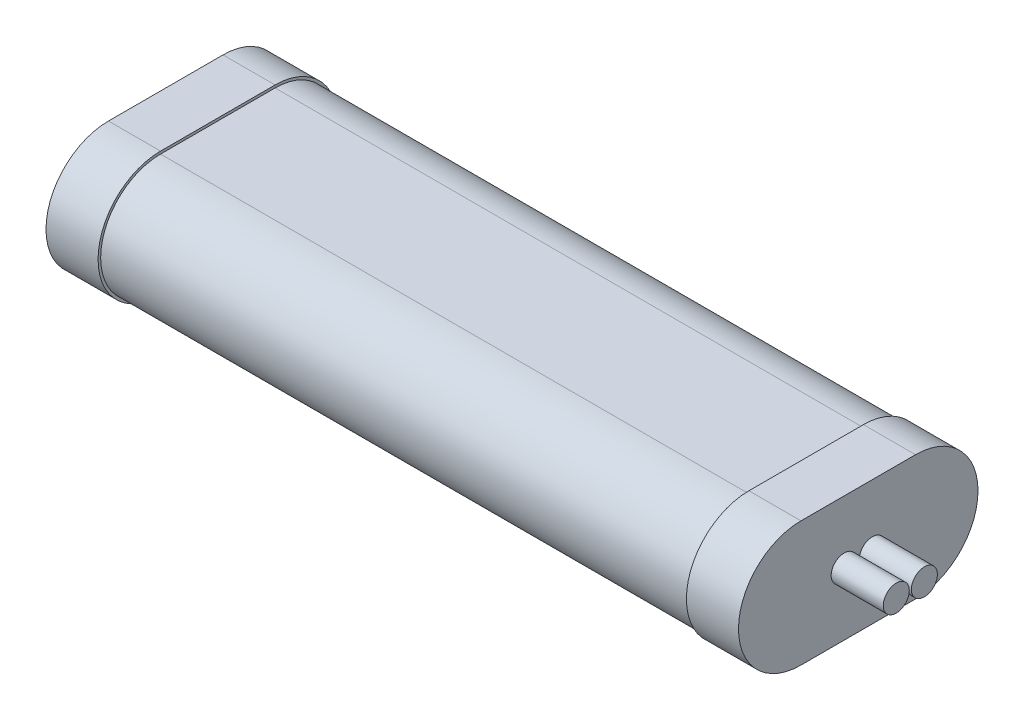
ISO-10303-21;
HEADER;
FILE_DESCRIPTION(('STEP AP214'),'2;1');
FILE_NAME('part.step','',(''),(''),'','','');
FILE_SCHEMA(('AUTOMOTIVE_DESIGN { 1 0 10303 214 1 1 1 1 }'));
ENDSEC;
DATA;
#1=APPLICATION_CONTEXT('core data for automotive mechanical design processes');
#2=APPLICATION_PROTOCOL_DEFINITION('international standard','automotive_design',2000,#1);
#3=PRODUCT_CONTEXT('',#1,'mechanical');
#4=PRODUCT('Part','Part','',(#3));
#5=PRODUCT_RELATED_PRODUCT_CATEGORY('part','',(#4));
#6=PRODUCT_DEFINITION_FORMATION('','',#4);
#7=PRODUCT_DEFINITION_CONTEXT('part definition',#1,'design');
#8=PRODUCT_DEFINITION('design','',#6,#7);
#9=PRODUCT_DEFINITION_SHAPE('','',#8);
#10=(LENGTH_UNIT() NAMED_UNIT(*) SI_UNIT(.MILLI.,.METRE.));
#11=(NAMED_UNIT(*) PLANE_ANGLE_UNIT() SI_UNIT($,.RADIAN.));
#12=(NAMED_UNIT(*) SI_UNIT($,.STERADIAN.) SOLID_ANGLE_UNIT());
#13=UNCERTAINTY_MEASURE_WITH_UNIT(LENGTH_MEASURE(1.E-05),#10,'distance_accuracy_value','');
#14=(GEOMETRIC_REPRESENTATION_CONTEXT(3) GLOBAL_UNCERTAINTY_ASSIGNED_CONTEXT((#13)) GLOBAL_UNIT_ASSIGNED_CONTEXT((#10,
#11,#12)) REPRESENTATION_CONTEXT('',''));
#15=CARTESIAN_POINT('',(0.,0.,0.));
#16=DIRECTION('',(0.,0.,1.));
#17=DIRECTION('',(1.,0.,0.));
#18=AXIS2_PLACEMENT_3D('',#15,#16,#17);
#19=CARTESIAN_POINT('',(56.5,0.,11.));
#20=DIRECTION('',(-1.,0.,0.));
#21=DIRECTION('',(0.,0.,1.));
#22=AXIS2_PLACEMENT_3D('',#19,#20,#21);
#23=CYLINDRICAL_SURFACE('',#22,11.5);
#24=CARTESIAN_POINT('',(-56.5,0.,11.));
#25=DIRECTION('',(1.,0.,0.));
#26=DIRECTION('',(0.,0.,-1.));
#27=AXIS2_PLACEMENT_3D('',#24,#25,#26);
#28=CIRCLE('',#27,11.5);
#29=CARTESIAN_POINT('',(-56.5,11.5,11.));
#30=VERTEX_POINT('',#29);
#31=CARTESIAN_POINT('',(-56.5,-11.5,11.));
#32=VERTEX_POINT('',#31);
#33=EDGE_CURVE('E207',#30,#32,#28,.T.);
#34=ORIENTED_EDGE('',*,*,#33,.T.);
#35=DIRECTION('',(-1.,0.,0.));
#36=VECTOR('',#35,1.);
#37=CARTESIAN_POINT('',(56.5,-11.5,11.));
#38=LINE('',#37,#36);
#39=CARTESIAN_POINT('',(56.5,-11.5,11.));
#40=VERTEX_POINT('',#39);
#41=EDGE_CURVE('E51',#40,#32,#38,.T.);
#42=ORIENTED_EDGE('',*,*,#41,.F.);
#43=CARTESIAN_POINT('',(56.5,0.,11.));
#44=DIRECTION('',(1.,0.,0.));
#45=DIRECTION('',(0.,0.,-1.));
#46=AXIS2_PLACEMENT_3D('',#43,#44,#45);
#47=CIRCLE('',#46,11.5);
#48=CARTESIAN_POINT('',(56.5,11.5,11.));
#49=VERTEX_POINT('',#48);
#50=EDGE_CURVE('E208',#49,#40,#47,.T.);
#51=ORIENTED_EDGE('',*,*,#50,.F.);
#52=DIRECTION('',(-1.,0.,0.));
#53=VECTOR('',#52,1.);
#54=CARTESIAN_POINT('',(56.5,11.5,11.));
#55=LINE('',#54,#53);
#56=EDGE_CURVE('E221',#49,#30,#55,.T.);
#57=ORIENTED_EDGE('',*,*,#56,.T.);
#58=EDGE_LOOP('',(#34,#42,#51,#57));
#59=FACE_BOUND('',#58,.T.);
#60=ADVANCED_FACE('F48',(#59),#23,.T.);
#61=CARTESIAN_POINT('',(56.5,-11.5,11.));
#62=DIRECTION('',(0.,1.,0.));
#63=DIRECTION('',(0.,0.,1.));
#64=AXIS2_PLACEMENT_3D('',#61,#62,#63);
#65=PLANE('',#64);
#66=DIRECTION('',(0.,0.,-1.));
#67=VECTOR('',#66,1.);
#68=CARTESIAN_POINT('',(-56.5,-11.5,11.));
#69=LINE('',#68,#67);
#70=CARTESIAN_POINT('',(-56.5,-11.5,-11.));
#71=VERTEX_POINT('',#70);
#72=EDGE_CURVE('E224',#32,#71,#69,.T.);
#73=ORIENTED_EDGE('',*,*,#72,.T.);
#74=DIRECTION('',(-1.,0.,0.));
#75=VECTOR('',#74,1.);
#76=CARTESIAN_POINT('',(56.5,-11.5,-11.));
#77=LINE('',#76,#75);
#78=CARTESIAN_POINT('',(56.5,-11.5,-11.));
#79=VERTEX_POINT('',#78);
#80=EDGE_CURVE('E233',#79,#71,#77,.T.);
#81=ORIENTED_EDGE('',*,*,#80,.F.);
#82=DIRECTION('',(0.,0.,-1.));
#83=VECTOR('',#82,1.);
#84=CARTESIAN_POINT('',(56.5,-11.5,11.));
#85=LINE('',#84,#83);
#86=EDGE_CURVE('E211',#40,#79,#85,.T.);
#87=ORIENTED_EDGE('',*,*,#86,.F.);
#88=ORIENTED_EDGE('',*,*,#41,.T.);
#89=EDGE_LOOP('',(#73,#81,#87,#88));
#90=FACE_BOUND('',#89,.T.);
#91=ADVANCED_FACE('F238',(#90),#65,.F.);
#92=CARTESIAN_POINT('',(56.5,0.,-11.));
#93=DIRECTION('',(-1.,0.,0.));
#94=DIRECTION('',(0.,0.,1.));
#95=AXIS2_PLACEMENT_3D('',#92,#93,#94);
#96=CYLINDRICAL_SURFACE('',#95,11.5);
#97=CARTESIAN_POINT('',(-56.5,0.,-11.));
#98=DIRECTION('',(1.,0.,0.));
#99=DIRECTION('',(0.,0.,1.));
#100=AXIS2_PLACEMENT_3D('',#97,#98,#99);
#101=CIRCLE('',#100,11.5);
#102=CARTESIAN_POINT('',(-56.5,11.5,-11.));
#103=VERTEX_POINT('',#102);
#104=EDGE_CURVE('E227',#71,#103,#101,.T.);
#105=ORIENTED_EDGE('',*,*,#104,.T.);
#106=DIRECTION('',(-1.,0.,0.));
#107=VECTOR('',#106,1.);
#108=CARTESIAN_POINT('',(56.5,11.5,-11.));
#109=LINE('',#108,#107);
#110=CARTESIAN_POINT('',(56.5,11.5,-11.));
#111=VERTEX_POINT('',#110);
#112=EDGE_CURVE('E64',#111,#103,#109,.T.);
#113=ORIENTED_EDGE('',*,*,#112,.F.);
#114=CARTESIAN_POINT('',(56.5,0.,-11.));
#115=DIRECTION('',(1.,0.,0.));
#116=DIRECTION('',(0.,0.,1.));
#117=AXIS2_PLACEMENT_3D('',#114,#115,#116);
#118=CIRCLE('',#117,11.5);
#119=EDGE_CURVE('E215',#79,#111,#118,.T.);
#120=ORIENTED_EDGE('',*,*,#119,.F.);
#121=ORIENTED_EDGE('',*,*,#80,.T.);
#122=EDGE_LOOP('',(#105,#113,#120,#121));
#123=FACE_BOUND('',#122,.T.);
#124=ADVANCED_FACE('F249',(#123),#96,.T.);
#125=CARTESIAN_POINT('',(56.5,11.5,11.));
#126=DIRECTION('',(0.,-1.,0.));
#127=DIRECTION('',(0.,0.,-1.));
#128=AXIS2_PLACEMENT_3D('',#125,#126,#127);
#129=PLANE('',#128);
#130=DIRECTION('',(0.,0.,1.));
#131=VECTOR('',#130,1.);
#132=CARTESIAN_POINT('',(-56.5,11.5,11.));
#133=LINE('',#132,#131);
#134=EDGE_CURVE('E212',#103,#30,#133,.T.);
#135=ORIENTED_EDGE('',*,*,#134,.T.);
#136=ORIENTED_EDGE('',*,*,#56,.F.);
#137=DIRECTION('',(0.,0.,1.));
#138=VECTOR('',#137,1.);
#139=CARTESIAN_POINT('',(56.5,11.5,11.));
#140=LINE('',#139,#138);
#141=EDGE_CURVE('E218',#111,#49,#140,.T.);
#142=ORIENTED_EDGE('',*,*,#141,.F.);
#143=ORIENTED_EDGE('',*,*,#112,.T.);
#144=EDGE_LOOP('',(#135,#136,#142,#143));
#145=FACE_BOUND('',#144,.T.);
#146=ADVANCED_FACE('F246',(#145),#129,.F.);
#147=CARTESIAN_POINT('',(56.5,0.,11.));
#148=DIRECTION('',(1.,0.,0.));
#149=DIRECTION('',(0.,0.,-1.));
#150=AXIS2_PLACEMENT_3D('',#147,#148,#149);
#151=PLANE('',#150);
#152=CARTESIAN_POINT('',(56.5,0.,11.));
#153=DIRECTION('',(1.,0.,0.));
#154=DIRECTION('',(0.,0.,-1.));
#155=AXIS2_PLACEMENT_3D('',#152,#153,#154);
#156=CIRCLE('',#155,12.);
#157=CARTESIAN_POINT('',(56.5,12.,11.));
#158=VERTEX_POINT('',#157);
#159=CARTESIAN_POINT('',(56.5,-12.,11.));
#160=VERTEX_POINT('',#159);
#161=EDGE_CURVE('E145',#158,#160,#156,.T.);
#162=ORIENTED_EDGE('',*,*,#161,.F.);
#163=DIRECTION('',(0.,0.,1.));
#164=VECTOR('',#163,1.);
#165=CARTESIAN_POINT('',(56.5,12.,11.));
#166=LINE('',#165,#164);
#167=CARTESIAN_POINT('',(56.5,12.,-11.));
#168=VERTEX_POINT('',#167);
#169=EDGE_CURVE('E182',#168,#158,#166,.T.);
#170=ORIENTED_EDGE('',*,*,#169,.F.);
#171=CARTESIAN_POINT('',(56.5,0.,-11.));
#172=DIRECTION('',(1.,0.,0.));
#173=DIRECTION('',(0.,0.,1.));
#174=AXIS2_PLACEMENT_3D('',#171,#172,#173);
#175=CIRCLE('',#174,12.);
#176=CARTESIAN_POINT('',(56.5,-12.,-11.));
#177=VERTEX_POINT('',#176);
#178=EDGE_CURVE('E193',#177,#168,#175,.T.);
#179=ORIENTED_EDGE('',*,*,#178,.F.);
#180=DIRECTION('',(0.,0.,-1.));
#181=VECTOR('',#180,1.);
#182=CARTESIAN_POINT('',(56.5,-12.,11.));
#183=LINE('',#182,#181);
#184=EDGE_CURVE('E191',#160,#177,#183,.T.);
#185=ORIENTED_EDGE('',*,*,#184,.F.);
#186=EDGE_LOOP('',(#162,#170,#179,#185));
#187=FACE_BOUND('',#186,.T.);
#188=ORIENTED_EDGE('',*,*,#141,.T.);
#189=ORIENTED_EDGE('',*,*,#50,.T.);
#190=ORIENTED_EDGE('',*,*,#86,.T.);
#191=ORIENTED_EDGE('',*,*,#119,.T.);
#192=EDGE_LOOP('',(#188,#189,#190,#191));
#193=FACE_BOUND('',#192,.T.);
#194=ADVANCED_FACE('F248',(#187,#193),#151,.F.);
#195=CARTESIAN_POINT('',(66.5,0.,11.));
#196=DIRECTION('',(-1.,0.,0.));
#197=DIRECTION('',(0.,0.,1.));
#198=AXIS2_PLACEMENT_3D('',#195,#196,#197);
#199=CYLINDRICAL_SURFACE('',#198,12.);
#200=ORIENTED_EDGE('',*,*,#161,.T.);
#201=DIRECTION('',(-1.,0.,0.));
#202=VECTOR('',#201,1.);
#203=CARTESIAN_POINT('',(66.5,-12.,11.));
#204=LINE('',#203,#202);
#205=CARTESIAN_POINT('',(66.5,-12.,11.));
#206=VERTEX_POINT('',#205);
#207=EDGE_CURVE('E204',#206,#160,#204,.T.);
#208=ORIENTED_EDGE('',*,*,#207,.F.);
#209=CARTESIAN_POINT('',(66.5,0.,11.));
#210=DIRECTION('',(1.,0.,0.));
#211=DIRECTION('',(0.,0.,-1.));
#212=AXIS2_PLACEMENT_3D('',#209,#210,#211);
#213=CIRCLE('',#212,12.);
#214=CARTESIAN_POINT('',(66.5,12.,11.));
#215=VERTEX_POINT('',#214);
#216=EDGE_CURVE('E178',#215,#206,#213,.T.);
#217=ORIENTED_EDGE('',*,*,#216,.F.);
#218=DIRECTION('',(-1.,0.,0.));
#219=VECTOR('',#218,1.);
#220=CARTESIAN_POINT('',(66.5,12.,11.));
#221=LINE('',#220,#219);
#222=EDGE_CURVE('E188',#215,#158,#221,.T.);
#223=ORIENTED_EDGE('',*,*,#222,.T.);
#224=EDGE_LOOP('',(#200,#208,#217,#223));
#225=FACE_BOUND('',#224,.T.);
#226=ADVANCED_FACE('F284',(#225),#199,.T.);
#227=CARTESIAN_POINT('',(66.5,-12.,11.));
#228=DIRECTION('',(0.,1.,0.));
#229=DIRECTION('',(0.,0.,1.));
#230=AXIS2_PLACEMENT_3D('',#227,#228,#229);
#231=PLANE('',#230);
#232=ORIENTED_EDGE('',*,*,#184,.T.);
#233=DIRECTION('',(-1.,0.,0.));
#234=VECTOR('',#233,1.);
#235=CARTESIAN_POINT('',(66.5,-12.,-11.));
#236=LINE('',#235,#234);
#237=CARTESIAN_POINT('',(66.5,-12.,-11.));
#238=VERTEX_POINT('',#237);
#239=EDGE_CURVE('E201',#238,#177,#236,.T.);
#240=ORIENTED_EDGE('',*,*,#239,.F.);
#241=DIRECTION('',(0.,0.,-1.));
#242=VECTOR('',#241,1.);
#243=CARTESIAN_POINT('',(66.5,-12.,11.));
#244=LINE('',#243,#242);
#245=EDGE_CURVE('E181',#206,#238,#244,.T.);
#246=ORIENTED_EDGE('',*,*,#245,.F.);
#247=ORIENTED_EDGE('',*,*,#207,.T.);
#248=EDGE_LOOP('',(#232,#240,#246,#247));
#249=FACE_BOUND('',#248,.T.);
#250=ADVANCED_FACE('F294',(#249),#231,.F.);
#251=CARTESIAN_POINT('',(66.5,0.,-11.));
#252=DIRECTION('',(-1.,0.,0.));
#253=DIRECTION('',(0.,0.,1.));
#254=AXIS2_PLACEMENT_3D('',#251,#252,#253);
#255=CYLINDRICAL_SURFACE('',#254,12.);
#256=ORIENTED_EDGE('',*,*,#178,.T.);
#257=DIRECTION('',(-1.,0.,0.));
#258=VECTOR('',#257,1.);
#259=CARTESIAN_POINT('',(66.5,12.,-11.));
#260=LINE('',#259,#258);
#261=CARTESIAN_POINT('',(66.5,12.,-11.));
#262=VERTEX_POINT('',#261);
#263=EDGE_CURVE('E198',#262,#168,#260,.T.);
#264=ORIENTED_EDGE('',*,*,#263,.F.);
#265=CARTESIAN_POINT('',(66.5,0.,-11.));
#266=DIRECTION('',(1.,0.,0.));
#267=DIRECTION('',(0.,0.,1.));
#268=AXIS2_PLACEMENT_3D('',#265,#266,#267);
#269=CIRCLE('',#268,12.);
#270=EDGE_CURVE('E184',#238,#262,#269,.T.);
#271=ORIENTED_EDGE('',*,*,#270,.F.);
#272=ORIENTED_EDGE('',*,*,#239,.T.);
#273=EDGE_LOOP('',(#256,#264,#271,#272));
#274=FACE_BOUND('',#273,.T.);
#275=ADVANCED_FACE('F304',(#274),#255,.T.);
#276=CARTESIAN_POINT('',(66.5,12.,11.));
#277=DIRECTION('',(0.,-1.,0.));
#278=DIRECTION('',(0.,0.,-1.));
#279=AXIS2_PLACEMENT_3D('',#276,#277,#278);
#280=PLANE('',#279);
#281=ORIENTED_EDGE('',*,*,#169,.T.);
#282=ORIENTED_EDGE('',*,*,#222,.F.);
#283=DIRECTION('',(0.,0.,1.));
#284=VECTOR('',#283,1.);
#285=CARTESIAN_POINT('',(66.5,12.,11.));
#286=LINE('',#285,#284);
#287=EDGE_CURVE('E186',#262,#215,#286,.T.);
#288=ORIENTED_EDGE('',*,*,#287,.F.);
#289=ORIENTED_EDGE('',*,*,#263,.T.);
#290=EDGE_LOOP('',(#281,#282,#288,#289));
#291=FACE_BOUND('',#290,.T.);
#292=ADVANCED_FACE('F314',(#291),#280,.F.);
#293=CARTESIAN_POINT('',(66.5,0.,11.));
#294=DIRECTION('',(1.,0.,0.));
#295=DIRECTION('',(0.,0.,-1.));
#296=AXIS2_PLACEMENT_3D('',#293,#294,#295);
#297=PLANE('',#296);
#298=CARTESIAN_POINT('',(66.5,0.,-2.7));
#299=DIRECTION('',(1.,0.,0.));
#300=DIRECTION('',(0.,0.,1.));
#301=AXIS2_PLACEMENT_3D('',#298,#299,#300);
#302=CIRCLE('',#301,2.5);
#303=CARTESIAN_POINT('',(66.5,0.,-0.2));
#304=VERTEX_POINT('',#303);
#305=EDGE_CURVE('E527',#304,#304,#302,.T.);
#306=ORIENTED_EDGE('',*,*,#305,.F.);
#307=EDGE_LOOP('',(#306));
#308=FACE_BOUND('',#307,.T.);
#309=CARTESIAN_POINT('',(66.5,0.,2.7));
#310=DIRECTION('',(1.,0.,0.));
#311=DIRECTION('',(0.,0.,-1.));
#312=AXIS2_PLACEMENT_3D('',#309,#310,#311);
#313=CIRCLE('',#312,2.5);
#314=CARTESIAN_POINT('',(66.5,0.,0.2));
#315=VERTEX_POINT('',#314);
#316=EDGE_CURVE('E11',#315,#315,#313,.T.);
#317=ORIENTED_EDGE('',*,*,#316,.F.);
#318=EDGE_LOOP('',(#317));
#319=FACE_BOUND('',#318,.T.);
#320=ORIENTED_EDGE('',*,*,#216,.T.);
#321=ORIENTED_EDGE('',*,*,#245,.T.);
#322=ORIENTED_EDGE('',*,*,#270,.T.);
#323=ORIENTED_EDGE('',*,*,#287,.T.);
#324=EDGE_LOOP('',(#320,#321,#322,#323));
#325=FACE_BOUND('',#324,.T.);
#326=ADVANCED_FACE('F324',(#308,#319,#325),#297,.T.);
#327=CARTESIAN_POINT('',(-66.5,0.,11.));
#328=DIRECTION('',(1.,0.,0.));
#329=DIRECTION('',(0.,0.,-1.));
#330=AXIS2_PLACEMENT_3D('',#327,#328,#329);
#331=CYLINDRICAL_SURFACE('',#330,12.);
#332=CARTESIAN_POINT('',(-56.5,0.,11.));
#333=DIRECTION('',(1.,0.,0.));
#334=DIRECTION('',(0.,0.,-1.));
#335=AXIS2_PLACEMENT_3D('',#332,#333,#334);
#336=CIRCLE('',#335,12.);
#337=CARTESIAN_POINT('',(-56.5,12.,11.));
#338=VERTEX_POINT('',#337);
#339=CARTESIAN_POINT('',(-56.5,-12.,11.));
#340=VERTEX_POINT('',#339);
#341=EDGE_CURVE('E140',#338,#340,#336,.T.);
#342=ORIENTED_EDGE('',*,*,#341,.F.);
#343=DIRECTION('',(1.,0.,0.));
#344=VECTOR('',#343,1.);
#345=CARTESIAN_POINT('',(-66.5,12.,11.));
#346=LINE('',#345,#344);
#347=CARTESIAN_POINT('',(-66.5,12.,11.));
#348=VERTEX_POINT('',#347);
#349=EDGE_CURVE('E134',#348,#338,#346,.T.);
#350=ORIENTED_EDGE('',*,*,#349,.F.);
#351=CARTESIAN_POINT('',(-66.5,0.,11.));
#352=DIRECTION('',(1.,0.,0.));
#353=DIRECTION('',(0.,0.,-1.));
#354=AXIS2_PLACEMENT_3D('',#351,#352,#353);
#355=CIRCLE('',#354,12.);
#356=CARTESIAN_POINT('',(-66.5,-12.,11.));
#357=VERTEX_POINT('',#356);
#358=EDGE_CURVE('E137',#348,#357,#355,.T.);
#359=ORIENTED_EDGE('',*,*,#358,.T.);
#360=DIRECTION('',(1.,0.,0.));
#361=VECTOR('',#360,1.);
#362=CARTESIAN_POINT('',(-66.5,-12.,11.));
#363=LINE('',#362,#361);
#364=EDGE_CURVE('E164',#357,#340,#363,.T.);
#365=ORIENTED_EDGE('',*,*,#364,.T.);
#366=EDGE_LOOP('',(#342,#350,#359,#365));
#367=FACE_BOUND('',#366,.T.);
#368=ADVANCED_FACE('F136',(#367),#331,.T.);
#369=CARTESIAN_POINT('',(-66.5,12.,11.));
#370=DIRECTION('',(0.,1.,0.));
#371=DIRECTION('',(0.,0.,1.));
#372=AXIS2_PLACEMENT_3D('',#369,#370,#371);
#373=PLANE('',#372);
#374=DIRECTION('',(0.,0.,1.));
#375=VECTOR('',#374,1.);
#376=CARTESIAN_POINT('',(-56.5,12.,11.));
#377=LINE('',#376,#375);
#378=CARTESIAN_POINT('',(-56.5,12.,-11.));
#379=VERTEX_POINT('',#378);
#380=EDGE_CURVE('E166',#379,#338,#377,.T.);
#381=ORIENTED_EDGE('',*,*,#380,.F.);
#382=DIRECTION('',(1.,0.,0.));
#383=VECTOR('',#382,1.);
#384=CARTESIAN_POINT('',(-66.5,12.,-11.));
#385=LINE('',#384,#383);
#386=CARTESIAN_POINT('',(-66.5,12.,-11.));
#387=VERTEX_POINT('',#386);
#388=EDGE_CURVE('E146',#387,#379,#385,.T.);
#389=ORIENTED_EDGE('',*,*,#388,.F.);
#390=DIRECTION('',(0.,0.,1.));
#391=VECTOR('',#390,1.);
#392=CARTESIAN_POINT('',(-66.5,12.,11.));
#393=LINE('',#392,#391);
#394=EDGE_CURVE('E152',#387,#348,#393,.T.);
#395=ORIENTED_EDGE('',*,*,#394,.T.);
#396=ORIENTED_EDGE('',*,*,#349,.T.);
#397=EDGE_LOOP('',(#381,#389,#395,#396));
#398=FACE_BOUND('',#397,.T.);
#399=ADVANCED_FACE('F158',(#398),#373,.T.);
#400=CARTESIAN_POINT('',(-66.5,0.,-11.));
#401=DIRECTION('',(1.,0.,0.));
#402=DIRECTION('',(0.,0.,-1.));
#403=AXIS2_PLACEMENT_3D('',#400,#401,#402);
#404=CYLINDRICAL_SURFACE('',#403,12.);
#405=CARTESIAN_POINT('',(-56.5,0.,-11.));
#406=DIRECTION('',(1.,0.,0.));
#407=DIRECTION('',(0.,0.,1.));
#408=AXIS2_PLACEMENT_3D('',#405,#406,#407);
#409=CIRCLE('',#408,12.);
#410=CARTESIAN_POINT('',(-56.5,-12.,-11.));
#411=VERTEX_POINT('',#410);
#412=EDGE_CURVE('E169',#411,#379,#409,.T.);
#413=ORIENTED_EDGE('',*,*,#412,.F.);
#414=DIRECTION('',(1.,0.,0.));
#415=VECTOR('',#414,1.);
#416=CARTESIAN_POINT('',(-66.5,-12.,-11.));
#417=LINE('',#416,#415);
#418=CARTESIAN_POINT('',(-66.5,-12.,-11.));
#419=VERTEX_POINT('',#418);
#420=EDGE_CURVE('E175',#419,#411,#417,.T.);
#421=ORIENTED_EDGE('',*,*,#420,.F.);
#422=CARTESIAN_POINT('',(-66.5,0.,-11.));
#423=DIRECTION('',(1.,0.,0.));
#424=DIRECTION('',(0.,0.,1.));
#425=AXIS2_PLACEMENT_3D('',#422,#423,#424);
#426=CIRCLE('',#425,12.);
#427=EDGE_CURVE('E159',#419,#387,#426,.T.);
#428=ORIENTED_EDGE('',*,*,#427,.T.);
#429=ORIENTED_EDGE('',*,*,#388,.T.);
#430=EDGE_LOOP('',(#413,#421,#428,#429));
#431=FACE_BOUND('',#430,.T.);
#432=ADVANCED_FACE('F354',(#431),#404,.T.);
#433=CARTESIAN_POINT('',(-66.5,-12.,11.));
#434=DIRECTION('',(0.,-1.,0.));
#435=DIRECTION('',(0.,0.,-1.));
#436=AXIS2_PLACEMENT_3D('',#433,#434,#435);
#437=PLANE('',#436);
#438=DIRECTION('',(0.,0.,-1.));
#439=VECTOR('',#438,1.);
#440=CARTESIAN_POINT('',(-56.5,-12.,11.));
#441=LINE('',#440,#439);
#442=EDGE_CURVE('E156',#340,#411,#441,.T.);
#443=ORIENTED_EDGE('',*,*,#442,.F.);
#444=ORIENTED_EDGE('',*,*,#364,.F.);
#445=DIRECTION('',(0.,0.,-1.));
#446=VECTOR('',#445,1.);
#447=CARTESIAN_POINT('',(-66.5,-12.,11.));
#448=LINE('',#447,#446);
#449=EDGE_CURVE('E155',#357,#419,#448,.T.);
#450=ORIENTED_EDGE('',*,*,#449,.T.);
#451=ORIENTED_EDGE('',*,*,#420,.T.);
#452=EDGE_LOOP('',(#443,#444,#450,#451));
#453=FACE_BOUND('',#452,.T.);
#454=ADVANCED_FACE('F364',(#453),#437,.T.);
#455=CARTESIAN_POINT('',(-66.5,0.,11.));
#456=DIRECTION('',(-1.,0.,0.));
#457=DIRECTION('',(0.,0.,-1.));
#458=AXIS2_PLACEMENT_3D('',#455,#456,#457);
#459=PLANE('',#458);
#460=ORIENTED_EDGE('',*,*,#358,.F.);
#461=ORIENTED_EDGE('',*,*,#394,.F.);
#462=ORIENTED_EDGE('',*,*,#427,.F.);
#463=ORIENTED_EDGE('',*,*,#449,.F.);
#464=EDGE_LOOP('',(#460,#461,#462,#463));
#465=FACE_BOUND('',#464,.T.);
#466=ADVANCED_FACE('F150',(#465),#459,.T.);
#467=CARTESIAN_POINT('',(-56.5,0.,11.));
#468=DIRECTION('',(-1.,0.,0.));
#469=DIRECTION('',(0.,0.,-1.));
#470=AXIS2_PLACEMENT_3D('',#467,#468,#469);
#471=PLANE('',#470);
#472=ORIENTED_EDGE('',*,*,#33,.F.);
#473=ORIENTED_EDGE('',*,*,#134,.F.);
#474=ORIENTED_EDGE('',*,*,#104,.F.);
#475=ORIENTED_EDGE('',*,*,#72,.F.);
#476=EDGE_LOOP('',(#472,#473,#474,#475));
#477=FACE_BOUND('',#476,.T.);
#478=ORIENTED_EDGE('',*,*,#341,.T.);
#479=ORIENTED_EDGE('',*,*,#442,.T.);
#480=ORIENTED_EDGE('',*,*,#412,.T.);
#481=ORIENTED_EDGE('',*,*,#380,.T.);
#482=EDGE_LOOP('',(#478,#479,#480,#481));
#483=FACE_BOUND('',#482,.T.);
#484=ADVANCED_FACE('F242',(#477,#483),#471,.F.);
#485=CARTESIAN_POINT('',(76.5,0.,2.7));
#486=DIRECTION('',(-1.,0.,0.));
#487=DIRECTION('',(0.,0.,1.));
#488=AXIS2_PLACEMENT_3D('',#485,#486,#487);
#489=CYLINDRICAL_SURFACE('',#488,2.5);
#490=CARTESIAN_POINT('',(76.5,0.,2.7));
#491=DIRECTION('',(1.,0.,0.));
#492=DIRECTION('',(0.,0.,-1.));
#493=AXIS2_PLACEMENT_3D('',#490,#491,#492);
#494=CIRCLE('',#493,2.5);
#495=CARTESIAN_POINT('',(76.5,0.,0.2));
#496=VERTEX_POINT('',#495);
#497=EDGE_CURVE('E167',#496,#496,#494,.T.);
#498=ORIENTED_EDGE('',*,*,#497,.F.);
#499=EDGE_LOOP('',(#498));
#500=FACE_BOUND('',#499,.T.);
#501=ORIENTED_EDGE('',*,*,#316,.T.);
#502=EDGE_LOOP('',(#501));
#503=FACE_BOUND('',#502,.T.);
#504=ADVANCED_FACE('F388',(#500,#503),#489,.T.);
#505=CARTESIAN_POINT('',(76.5,0.,2.7));
#506=DIRECTION('',(1.,0.,0.));
#507=DIRECTION('',(0.,0.,-1.));
#508=AXIS2_PLACEMENT_3D('',#505,#506,#507);
#509=PLANE('',#508);
#510=ORIENTED_EDGE('',*,*,#497,.T.);
#511=EDGE_LOOP('',(#510));
#512=FACE_BOUND('',#511,.T.);
#513=ADVANCED_FACE('F396',(#512),#509,.T.);
#514=CARTESIAN_POINT('',(76.5,0.,-2.7));
#515=DIRECTION('',(-1.,0.,0.));
#516=DIRECTION('',(0.,0.,1.));
#517=AXIS2_PLACEMENT_3D('',#514,#515,#516);
#518=CYLINDRICAL_SURFACE('',#517,2.5);
#519=CARTESIAN_POINT('',(76.5,0.,-2.7));
#520=DIRECTION('',(1.,0.,0.));
#521=DIRECTION('',(0.,0.,1.));
#522=AXIS2_PLACEMENT_3D('',#519,#520,#521);
#523=CIRCLE('',#522,2.5);
#524=CARTESIAN_POINT('',(76.5,0.,-0.2));
#525=VERTEX_POINT('',#524);
#526=EDGE_CURVE('E526',#525,#525,#523,.T.);
#527=ORIENTED_EDGE('',*,*,#526,.F.);
#528=EDGE_LOOP('',(#527));
#529=FACE_BOUND('',#528,.T.);
#530=ORIENTED_EDGE('',*,*,#305,.T.);
#531=EDGE_LOOP('',(#530));
#532=FACE_BOUND('',#531,.T.);
#533=ADVANCED_FACE('F406',(#529,#532),#518,.T.);
#534=CARTESIAN_POINT('',(76.5,0.,-2.7));
#535=DIRECTION('',(-1.,0.,0.));
#536=DIRECTION('',(0.,0.,1.));
#537=AXIS2_PLACEMENT_3D('',#534,#535,#536);
#538=PLANE('',#537);
#539=ORIENTED_EDGE('',*,*,#526,.T.);
#540=EDGE_LOOP('',(#539));
#541=FACE_BOUND('',#540,.T.);
#542=ADVANCED_FACE('F416',(#541),#538,.F.);
#543=CLOSED_SHELL('',(#60,#91,#124,#146,#194,#226,#250,#275,#292,#326,#368,#399,#432,#454,#466,
#484,#504,#513,#533,#542));
#544=MANIFOLD_SOLID_BREP('B2',#543);
#545=ADVANCED_BREP_SHAPE_REPRESENTATION('',(#18,#544),#14);
#546=SHAPE_DEFINITION_REPRESENTATION(#9,#545);
ENDSEC;
END-ISO-10303-21;
